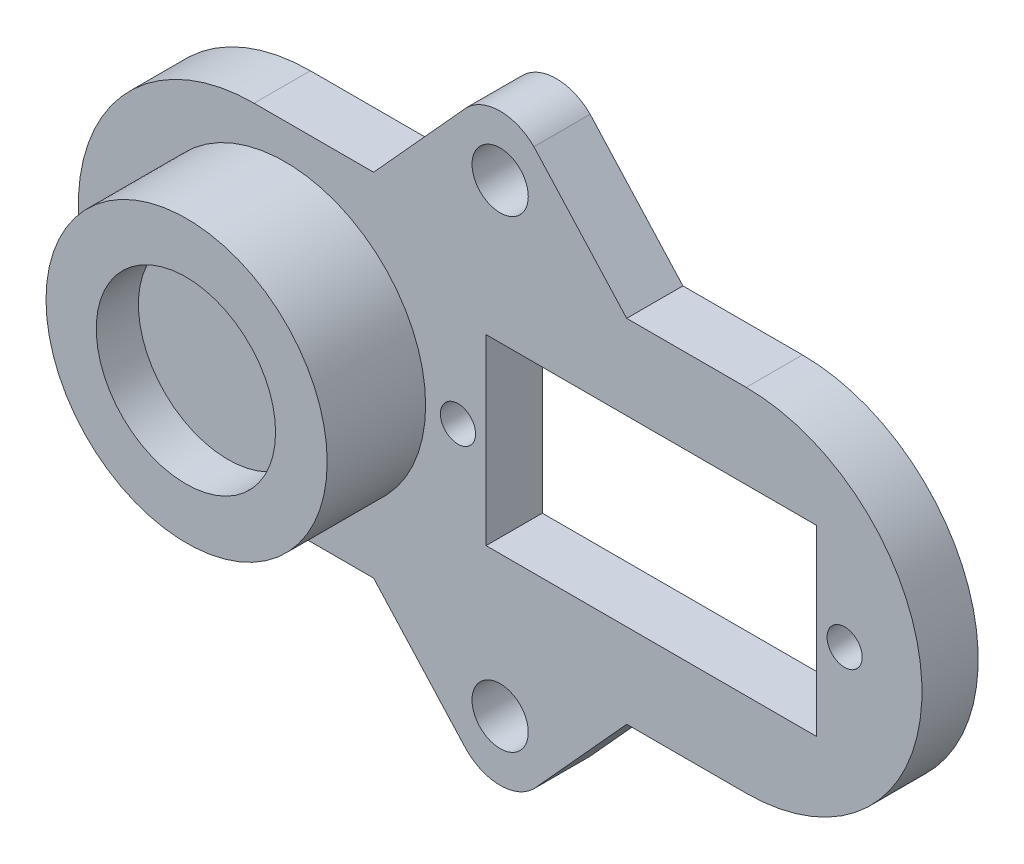
ISO-10303-21;
HEADER;
FILE_DESCRIPTION(('STEP AP214'),'2;1');
FILE_NAME('part.step','',(''),(''),'','','');
FILE_SCHEMA(('AUTOMOTIVE_DESIGN { 1 0 10303 214 1 1 1 1 }'));
ENDSEC;
DATA;
#1=APPLICATION_CONTEXT('core data for automotive mechanical design processes');
#2=APPLICATION_PROTOCOL_DEFINITION('international standard','automotive_design',2000,#1);
#3=PRODUCT_CONTEXT('',#1,'mechanical');
#4=PRODUCT('Part','Part','',(#3));
#5=PRODUCT_RELATED_PRODUCT_CATEGORY('part','',(#4));
#6=PRODUCT_DEFINITION_FORMATION('','',#4);
#7=PRODUCT_DEFINITION_CONTEXT('part definition',#1,'design');
#8=PRODUCT_DEFINITION('design','',#6,#7);
#9=PRODUCT_DEFINITION_SHAPE('','',#8);
#10=(LENGTH_UNIT() NAMED_UNIT(*) SI_UNIT(.MILLI.,.METRE.));
#11=(NAMED_UNIT(*) PLANE_ANGLE_UNIT() SI_UNIT($,.RADIAN.));
#12=(NAMED_UNIT(*) SI_UNIT($,.STERADIAN.) SOLID_ANGLE_UNIT());
#13=UNCERTAINTY_MEASURE_WITH_UNIT(LENGTH_MEASURE(1.E-05),#10,'distance_accuracy_value','');
#14=(GEOMETRIC_REPRESENTATION_CONTEXT(3) GLOBAL_UNCERTAINTY_ASSIGNED_CONTEXT((#13)) GLOBAL_UNIT_ASSIGNED_CONTEXT((#10,
#11,#12)) REPRESENTATION_CONTEXT('',''));
#15=CARTESIAN_POINT('',(0.,0.,0.));
#16=DIRECTION('',(0.,0.,1.));
#17=DIRECTION('',(1.,0.,0.));
#18=AXIS2_PLACEMENT_3D('',#15,#16,#17);
#19=CARTESIAN_POINT('',(17.5,0.,4.));
#20=DIRECTION('',(0.,0.,1.));
#21=DIRECTION('',(1.,0.,0.));
#22=AXIS2_PLACEMENT_3D('',#19,#20,#21);
#23=PLANE('',#22);
#24=CARTESIAN_POINT('',(-15.3,0.,4.));
#25=DIRECTION('',(0.,0.,1.));
#26=DIRECTION('',(1.,0.,0.));
#27=AXIS2_PLACEMENT_3D('',#24,#25,#26);
#28=CIRCLE('',#27,10.);
#29=CARTESIAN_POINT('',(-5.3,0.,4.));
#30=VERTEX_POINT('',#29);
#31=EDGE_CURVE('E644',#30,#30,#28,.T.);
#32=ORIENTED_EDGE('',*,*,#31,.F.);
#33=EDGE_LOOP('',(#32));
#34=FACE_BOUND('',#33,.T.);
#35=CARTESIAN_POINT('',(0.,-16.5,4.));
#36=DIRECTION('',(0.,0.,1.));
#37=DIRECTION('',(-1.,0.,0.));
#38=AXIS2_PLACEMENT_3D('',#35,#36,#37);
#39=CIRCLE('',#38,2.);
#40=CARTESIAN_POINT('',(-2.,-16.5,4.));
#41=VERTEX_POINT('',#40);
#42=EDGE_CURVE('E211',#41,#41,#39,.T.);
#43=ORIENTED_EDGE('',*,*,#42,.F.);
#44=EDGE_LOOP('',(#43));
#45=FACE_BOUND('',#44,.T.);
#46=CARTESIAN_POINT('',(-2.99999999999999,0.,4.));
#47=DIRECTION('',(0.,0.,1.));
#48=DIRECTION('',(1.,0.,0.));
#49=AXIS2_PLACEMENT_3D('',#46,#47,#48);
#50=CIRCLE('',#49,1.25);
#51=CARTESIAN_POINT('',(-1.74999999999999,0.,4.));
#52=VERTEX_POINT('',#51);
#53=EDGE_CURVE('E227',#52,#52,#50,.T.);
#54=ORIENTED_EDGE('',*,*,#53,.F.);
#55=EDGE_LOOP('',(#54));
#56=FACE_BOUND('',#55,.T.);
#57=CARTESIAN_POINT('',(17.5,0.,4.));
#58=DIRECTION('',(0.,0.,1.));
#59=DIRECTION('',(1.,0.,0.));
#60=AXIS2_PLACEMENT_3D('',#57,#58,#59);
#61=CIRCLE('',#60,12.5);
#62=CARTESIAN_POINT('',(17.5,-12.5,4.));
#63=VERTEX_POINT('',#62);
#64=CARTESIAN_POINT('',(17.5,12.5,4.));
#65=VERTEX_POINT('',#64);
#66=EDGE_CURVE('E235',#63,#65,#61,.T.);
#67=ORIENTED_EDGE('',*,*,#66,.T.);
#68=DIRECTION('',(-1.,0.,0.));
#69=VECTOR('',#68,1.);
#70=CARTESIAN_POINT('',(9.,12.5,4.));
#71=LINE('',#70,#69);
#72=CARTESIAN_POINT('',(9.,12.5,4.));
#73=VERTEX_POINT('',#72);
#74=EDGE_CURVE('E239',#65,#73,#71,.T.);
#75=ORIENTED_EDGE('',*,*,#74,.T.);
#76=DIRECTION('',(-0.671988671110962,0.740561426148111,0.));
#77=VECTOR('',#76,1.);
#78=CARTESIAN_POINT('',(2.4010102843855,19.772380391254,4.));
#79=LINE('',#78,#77);
#80=CARTESIAN_POINT('',(2.4010102843855,19.772380391254,4.));
#81=VERTEX_POINT('',#80);
#82=EDGE_CURVE('E243',#73,#81,#79,.T.);
#83=ORIENTED_EDGE('',*,*,#82,.T.);
#84=CARTESIAN_POINT('',(0.,17.3713701068685,4.));
#85=DIRECTION('',(0.,0.,1.));
#86=DIRECTION('',(-1.,0.,0.));
#87=AXIS2_PLACEMENT_3D('',#84,#85,#86);
#88=CIRCLE('',#87,3.39554130757526);
#89=CARTESIAN_POINT('',(-2.4010102843855,19.772380391254,4.));
#90=VERTEX_POINT('',#89);
#91=EDGE_CURVE('E246',#81,#90,#88,.T.);
#92=ORIENTED_EDGE('',*,*,#91,.T.);
#93=DIRECTION('',(-0.671988671110962,-0.740561426148111,0.));
#94=VECTOR('',#93,1.);
#95=CARTESIAN_POINT('',(-9.,12.5,4.));
#96=LINE('',#95,#94);
#97=CARTESIAN_POINT('',(-9.,12.5,4.));
#98=VERTEX_POINT('',#97);
#99=EDGE_CURVE('E249',#90,#98,#96,.T.);
#100=ORIENTED_EDGE('',*,*,#99,.T.);
#101=DIRECTION('',(-1.,0.,0.));
#102=VECTOR('',#101,1.);
#103=CARTESIAN_POINT('',(-17.5,12.5,4.));
#104=LINE('',#103,#102);
#105=CARTESIAN_POINT('',(-17.5,12.5,4.));
#106=VERTEX_POINT('',#105);
#107=EDGE_CURVE('E252',#98,#106,#104,.T.);
#108=ORIENTED_EDGE('',*,*,#107,.T.);
#109=CARTESIAN_POINT('',(-17.5,0.,4.));
#110=DIRECTION('',(0.,0.,1.));
#111=DIRECTION('',(1.,0.,0.));
#112=AXIS2_PLACEMENT_3D('',#109,#110,#111);
#113=CIRCLE('',#112,12.5);
#114=CARTESIAN_POINT('',(-17.5,-12.5,4.));
#115=VERTEX_POINT('',#114);
#116=EDGE_CURVE('E255',#106,#115,#113,.T.);
#117=ORIENTED_EDGE('',*,*,#116,.T.);
#118=DIRECTION('',(1.,0.,0.));
#119=VECTOR('',#118,1.);
#120=CARTESIAN_POINT('',(-17.5,-12.5,4.));
#121=LINE('',#120,#119);
#122=CARTESIAN_POINT('',(-9.,-12.5,4.));
#123=VERTEX_POINT('',#122);
#124=EDGE_CURVE('E258',#115,#123,#121,.T.);
#125=ORIENTED_EDGE('',*,*,#124,.T.);
#126=DIRECTION('',(0.671988671110962,-0.740561426148111,0.));
#127=VECTOR('',#126,1.);
#128=CARTESIAN_POINT('',(-9.,-12.5,4.));
#129=LINE('',#128,#127);
#130=CARTESIAN_POINT('',(-2.4010102843855,-19.772380391254,4.));
#131=VERTEX_POINT('',#130);
#132=EDGE_CURVE('E261',#123,#131,#129,.T.);
#133=ORIENTED_EDGE('',*,*,#132,.T.);
#134=CARTESIAN_POINT('',(0.,-17.3713701068685,4.));
#135=DIRECTION('',(0.,0.,1.));
#136=DIRECTION('',(1.,0.,0.));
#137=AXIS2_PLACEMENT_3D('',#134,#135,#136);
#138=CIRCLE('',#137,3.39554130757526);
#139=CARTESIAN_POINT('',(2.4010102843855,-19.772380391254,4.));
#140=VERTEX_POINT('',#139);
#141=EDGE_CURVE('E264',#131,#140,#138,.T.);
#142=ORIENTED_EDGE('',*,*,#141,.T.);
#143=DIRECTION('',(0.671988671110962,0.740561426148111,0.));
#144=VECTOR('',#143,1.);
#145=CARTESIAN_POINT('',(2.4010102843855,-19.772380391254,4.));
#146=LINE('',#145,#144);
#147=CARTESIAN_POINT('',(9.,-12.5,4.));
#148=VERTEX_POINT('',#147);
#149=EDGE_CURVE('E267',#140,#148,#146,.T.);
#150=ORIENTED_EDGE('',*,*,#149,.T.);
#151=DIRECTION('',(1.,0.,0.));
#152=VECTOR('',#151,1.);
#153=CARTESIAN_POINT('',(9.,-12.5,4.));
#154=LINE('',#153,#152);
#155=EDGE_CURVE('E270',#148,#63,#154,.T.);
#156=ORIENTED_EDGE('',*,*,#155,.T.);
#157=EDGE_LOOP('',(#67,#75,#83,#92,#100,#108,#117,#125,#133,#142,#150,#156));
#158=FACE_BOUND('',#157,.T.);
#159=CARTESIAN_POINT('',(0.,16.5,4.));
#160=DIRECTION('',(0.,0.,1.));
#161=DIRECTION('',(1.,0.,0.));
#162=AXIS2_PLACEMENT_3D('',#159,#160,#161);
#163=CIRCLE('',#162,2.);
#164=CARTESIAN_POINT('',(2.,16.5,4.));
#165=VERTEX_POINT('',#164);
#166=EDGE_CURVE('E219',#165,#165,#163,.T.);
#167=ORIENTED_EDGE('',*,*,#166,.F.);
#168=EDGE_LOOP('',(#167));
#169=FACE_BOUND('',#168,.T.);
#170=CARTESIAN_POINT('',(24.5,0.,4.));
#171=DIRECTION('',(0.,0.,1.));
#172=DIRECTION('',(1.,0.,0.));
#173=AXIS2_PLACEMENT_3D('',#170,#171,#172);
#174=CIRCLE('',#173,1.25);
#175=CARTESIAN_POINT('',(25.75,0.,4.));
#176=VERTEX_POINT('',#175);
#177=EDGE_CURVE('E203',#176,#176,#174,.T.);
#178=ORIENTED_EDGE('',*,*,#177,.F.);
#179=EDGE_LOOP('',(#178));
#180=FACE_BOUND('',#179,.T.);
#181=DIRECTION('',(1.,0.,0.));
#182=VECTOR('',#181,1.);
#183=CARTESIAN_POINT('',(-0.999999999999994,-6.5,4.));
#184=LINE('',#183,#182);
#185=CARTESIAN_POINT('',(-0.999999999999994,-6.5,4.));
#186=VERTEX_POINT('',#185);
#187=CARTESIAN_POINT('',(22.5,-6.5,4.));
#188=VERTEX_POINT('',#187);
#189=EDGE_CURVE('E162',#186,#188,#184,.T.);
#190=ORIENTED_EDGE('',*,*,#189,.F.);
#191=DIRECTION('',(0.,-1.,0.));
#192=VECTOR('',#191,1.);
#193=CARTESIAN_POINT('',(-0.999999999999994,6.5,4.));
#194=LINE('',#193,#192);
#195=CARTESIAN_POINT('',(-0.999999999999994,6.5,4.));
#196=VERTEX_POINT('',#195);
#197=EDGE_CURVE('E153',#196,#186,#194,.T.);
#198=ORIENTED_EDGE('',*,*,#197,.F.);
#199=DIRECTION('',(-1.,0.,0.));
#200=VECTOR('',#199,1.);
#201=CARTESIAN_POINT('',(-0.999999999999994,6.5,4.));
#202=LINE('',#201,#200);
#203=CARTESIAN_POINT('',(22.5,6.5,4.));
#204=VERTEX_POINT('',#203);
#205=EDGE_CURVE('E179',#204,#196,#202,.T.);
#206=ORIENTED_EDGE('',*,*,#205,.F.);
#207=DIRECTION('',(0.,1.,0.));
#208=VECTOR('',#207,1.);
#209=CARTESIAN_POINT('',(22.5,6.5,4.));
#210=LINE('',#209,#208);
#211=EDGE_CURVE('E175',#188,#204,#210,.T.);
#212=ORIENTED_EDGE('',*,*,#211,.F.);
#213=EDGE_LOOP('',(#190,#198,#206,#212));
#214=FACE_BOUND('',#213,.T.);
#215=ADVANCED_FACE('F39',(#34,#45,#56,#158,#169,#180,#214),#23,.T.);
#216=CARTESIAN_POINT('',(17.5,0.,0.));
#217=DIRECTION('',(0.,0.,1.));
#218=DIRECTION('',(1.,0.,0.));
#219=AXIS2_PLACEMENT_3D('',#216,#217,#218);
#220=PLANE('',#219);
#221=CARTESIAN_POINT('',(24.5,0.,0.));
#222=DIRECTION('',(0.,0.,1.));
#223=DIRECTION('',(1.,0.,0.));
#224=AXIS2_PLACEMENT_3D('',#221,#222,#223);
#225=CIRCLE('',#224,1.25);
#226=CARTESIAN_POINT('',(25.75,0.,0.));
#227=VERTEX_POINT('',#226);
#228=EDGE_CURVE('E171',#227,#227,#225,.T.);
#229=ORIENTED_EDGE('',*,*,#228,.T.);
#230=EDGE_LOOP('',(#229));
#231=FACE_BOUND('',#230,.T.);
#232=CARTESIAN_POINT('',(0.,-16.5,0.));
#233=DIRECTION('',(0.,0.,1.));
#234=DIRECTION('',(-1.,0.,0.));
#235=AXIS2_PLACEMENT_3D('',#232,#233,#234);
#236=CIRCLE('',#235,2.);
#237=CARTESIAN_POINT('',(-2.,-16.5,0.));
#238=VERTEX_POINT('',#237);
#239=EDGE_CURVE('E207',#238,#238,#236,.T.);
#240=ORIENTED_EDGE('',*,*,#239,.T.);
#241=EDGE_LOOP('',(#240));
#242=FACE_BOUND('',#241,.T.);
#243=CARTESIAN_POINT('',(0.,16.5,0.));
#244=DIRECTION('',(0.,0.,1.));
#245=DIRECTION('',(1.,0.,0.));
#246=AXIS2_PLACEMENT_3D('',#243,#244,#245);
#247=CIRCLE('',#246,2.);
#248=CARTESIAN_POINT('',(2.,16.5,0.));
#249=VERTEX_POINT('',#248);
#250=EDGE_CURVE('E215',#249,#249,#247,.T.);
#251=ORIENTED_EDGE('',*,*,#250,.T.);
#252=EDGE_LOOP('',(#251));
#253=FACE_BOUND('',#252,.T.);
#254=CARTESIAN_POINT('',(-2.99999999999999,0.,0.));
#255=DIRECTION('',(0.,0.,1.));
#256=DIRECTION('',(1.,0.,0.));
#257=AXIS2_PLACEMENT_3D('',#254,#255,#256);
#258=CIRCLE('',#257,1.25);
#259=CARTESIAN_POINT('',(-1.74999999999999,0.,0.));
#260=VERTEX_POINT('',#259);
#261=EDGE_CURVE('E223',#260,#260,#258,.T.);
#262=ORIENTED_EDGE('',*,*,#261,.T.);
#263=EDGE_LOOP('',(#262));
#264=FACE_BOUND('',#263,.T.);
#265=CARTESIAN_POINT('',(17.5,0.,0.));
#266=DIRECTION('',(0.,0.,1.));
#267=DIRECTION('',(1.,0.,0.));
#268=AXIS2_PLACEMENT_3D('',#265,#266,#267);
#269=CIRCLE('',#268,12.5);
#270=CARTESIAN_POINT('',(17.5,-12.5,0.));
#271=VERTEX_POINT('',#270);
#272=CARTESIAN_POINT('',(17.5,12.5,0.));
#273=VERTEX_POINT('',#272);
#274=EDGE_CURVE('E231',#271,#273,#269,.T.);
#275=ORIENTED_EDGE('',*,*,#274,.F.);
#276=DIRECTION('',(1.,0.,0.));
#277=VECTOR('',#276,1.);
#278=CARTESIAN_POINT('',(9.,-12.5,0.));
#279=LINE('',#278,#277);
#280=CARTESIAN_POINT('',(9.,-12.5,0.));
#281=VERTEX_POINT('',#280);
#282=EDGE_CURVE('E240',#281,#271,#279,.T.);
#283=ORIENTED_EDGE('',*,*,#282,.F.);
#284=DIRECTION('',(0.671988671110962,0.740561426148111,0.));
#285=VECTOR('',#284,1.);
#286=CARTESIAN_POINT('',(2.4010102843855,-19.772380391254,0.));
#287=LINE('',#286,#285);
#288=CARTESIAN_POINT('',(2.4010102843855,-19.772380391254,0.));
#289=VERTEX_POINT('',#288);
#290=EDGE_CURVE('E304',#289,#281,#287,.T.);
#291=ORIENTED_EDGE('',*,*,#290,.F.);
#292=CARTESIAN_POINT('',(0.,-17.3713701068685,0.));
#293=DIRECTION('',(0.,0.,1.));
#294=DIRECTION('',(1.,0.,0.));
#295=AXIS2_PLACEMENT_3D('',#292,#293,#294);
#296=CIRCLE('',#295,3.39554130757526);
#297=CARTESIAN_POINT('',(-2.4010102843855,-19.772380391254,0.));
#298=VERTEX_POINT('',#297);
#299=EDGE_CURVE('E301',#298,#289,#296,.T.);
#300=ORIENTED_EDGE('',*,*,#299,.F.);
#301=DIRECTION('',(0.671988671110962,-0.740561426148111,0.));
#302=VECTOR('',#301,1.);
#303=CARTESIAN_POINT('',(-9.,-12.5,0.));
#304=LINE('',#303,#302);
#305=CARTESIAN_POINT('',(-9.,-12.5,0.));
#306=VERTEX_POINT('',#305);
#307=EDGE_CURVE('E298',#306,#298,#304,.T.);
#308=ORIENTED_EDGE('',*,*,#307,.F.);
#309=DIRECTION('',(1.,0.,0.));
#310=VECTOR('',#309,1.);
#311=CARTESIAN_POINT('',(-17.5,-12.5,0.));
#312=LINE('',#311,#310);
#313=CARTESIAN_POINT('',(-17.5,-12.5,0.));
#314=VERTEX_POINT('',#313);
#315=EDGE_CURVE('E295',#314,#306,#312,.T.);
#316=ORIENTED_EDGE('',*,*,#315,.F.);
#317=CARTESIAN_POINT('',(-17.5,0.,0.));
#318=DIRECTION('',(0.,0.,1.));
#319=DIRECTION('',(1.,0.,0.));
#320=AXIS2_PLACEMENT_3D('',#317,#318,#319);
#321=CIRCLE('',#320,12.5);
#322=CARTESIAN_POINT('',(-17.5,12.5,0.));
#323=VERTEX_POINT('',#322);
#324=EDGE_CURVE('E292',#323,#314,#321,.T.);
#325=ORIENTED_EDGE('',*,*,#324,.F.);
#326=DIRECTION('',(-1.,0.,0.));
#327=VECTOR('',#326,1.);
#328=CARTESIAN_POINT('',(-17.5,12.5,0.));
#329=LINE('',#328,#327);
#330=CARTESIAN_POINT('',(-9.,12.5,0.));
#331=VERTEX_POINT('',#330);
#332=EDGE_CURVE('E289',#331,#323,#329,.T.);
#333=ORIENTED_EDGE('',*,*,#332,.F.);
#334=DIRECTION('',(-0.671988671110962,-0.740561426148111,0.));
#335=VECTOR('',#334,1.);
#336=CARTESIAN_POINT('',(-9.,12.5,0.));
#337=LINE('',#336,#335);
#338=CARTESIAN_POINT('',(-2.4010102843855,19.772380391254,0.));
#339=VERTEX_POINT('',#338);
#340=EDGE_CURVE('E286',#339,#331,#337,.T.);
#341=ORIENTED_EDGE('',*,*,#340,.F.);
#342=CARTESIAN_POINT('',(0.,17.3713701068685,0.));
#343=DIRECTION('',(0.,0.,1.));
#344=DIRECTION('',(-1.,0.,0.));
#345=AXIS2_PLACEMENT_3D('',#342,#343,#344);
#346=CIRCLE('',#345,3.39554130757526);
#347=CARTESIAN_POINT('',(2.4010102843855,19.772380391254,0.));
#348=VERTEX_POINT('',#347);
#349=EDGE_CURVE('E283',#348,#339,#346,.T.);
#350=ORIENTED_EDGE('',*,*,#349,.F.);
#351=DIRECTION('',(-0.671988671110962,0.740561426148111,0.));
#352=VECTOR('',#351,1.);
#353=CARTESIAN_POINT('',(2.4010102843855,19.772380391254,0.));
#354=LINE('',#353,#352);
#355=CARTESIAN_POINT('',(9.,12.5,0.));
#356=VERTEX_POINT('',#355);
#357=EDGE_CURVE('E280',#356,#348,#354,.T.);
#358=ORIENTED_EDGE('',*,*,#357,.F.);
#359=DIRECTION('',(-1.,0.,0.));
#360=VECTOR('',#359,1.);
#361=CARTESIAN_POINT('',(9.,12.5,0.));
#362=LINE('',#361,#360);
#363=EDGE_CURVE('E277',#273,#356,#362,.T.);
#364=ORIENTED_EDGE('',*,*,#363,.F.);
#365=EDGE_LOOP('',(#275,#283,#291,#300,#308,#316,#325,#333,#341,#350,#358,#364));
#366=FACE_BOUND('',#365,.T.);
#367=DIRECTION('',(0.,-1.,0.));
#368=VECTOR('',#367,1.);
#369=CARTESIAN_POINT('',(-0.999999999999994,6.5,0.));
#370=LINE('',#369,#368);
#371=CARTESIAN_POINT('',(-0.999999999999994,6.5,0.));
#372=VERTEX_POINT('',#371);
#373=CARTESIAN_POINT('',(-0.999999999999994,-6.5,0.));
#374=VERTEX_POINT('',#373);
#375=EDGE_CURVE('E63',#372,#374,#370,.T.);
#376=ORIENTED_EDGE('',*,*,#375,.T.);
#377=DIRECTION('',(1.,0.,0.));
#378=VECTOR('',#377,1.);
#379=CARTESIAN_POINT('',(-0.999999999999994,-6.5,0.));
#380=LINE('',#379,#378);
#381=CARTESIAN_POINT('',(22.5,-6.5,0.));
#382=VERTEX_POINT('',#381);
#383=EDGE_CURVE('E169',#374,#382,#380,.T.);
#384=ORIENTED_EDGE('',*,*,#383,.T.);
#385=DIRECTION('',(0.,1.,0.));
#386=VECTOR('',#385,1.);
#387=CARTESIAN_POINT('',(22.5,6.5,0.));
#388=LINE('',#387,#386);
#389=CARTESIAN_POINT('',(22.5,6.5,0.));
#390=VERTEX_POINT('',#389);
#391=EDGE_CURVE('E190',#382,#390,#388,.T.);
#392=ORIENTED_EDGE('',*,*,#391,.T.);
#393=DIRECTION('',(-1.,0.,0.));
#394=VECTOR('',#393,1.);
#395=CARTESIAN_POINT('',(-0.999999999999994,6.5,0.));
#396=LINE('',#395,#394);
#397=EDGE_CURVE('E163',#390,#372,#396,.T.);
#398=ORIENTED_EDGE('',*,*,#397,.T.);
#399=EDGE_LOOP('',(#376,#384,#392,#398));
#400=FACE_BOUND('',#399,.T.);
#401=ADVANCED_FACE('F359',(#231,#242,#253,#264,#366,#400),#220,.F.);
#402=CARTESIAN_POINT('',(17.5,0.,4.));
#403=DIRECTION('',(0.,0.,-1.));
#404=DIRECTION('',(-1.,0.,0.));
#405=AXIS2_PLACEMENT_3D('',#402,#403,#404);
#406=CYLINDRICAL_SURFACE('',#405,12.5);
#407=ORIENTED_EDGE('',*,*,#274,.T.);
#408=DIRECTION('',(0.,0.,-1.));
#409=VECTOR('',#408,1.);
#410=CARTESIAN_POINT('',(17.5,12.5,4.));
#411=LINE('',#410,#409);
#412=EDGE_CURVE('E11',#65,#273,#411,.T.);
#413=ORIENTED_EDGE('',*,*,#412,.F.);
#414=ORIENTED_EDGE('',*,*,#66,.F.);
#415=DIRECTION('',(0.,0.,-1.));
#416=VECTOR('',#415,1.);
#417=CARTESIAN_POINT('',(17.5,-12.5,4.));
#418=LINE('',#417,#416);
#419=EDGE_CURVE('E273',#63,#271,#418,.T.);
#420=ORIENTED_EDGE('',*,*,#419,.T.);
#421=EDGE_LOOP('',(#407,#413,#414,#420));
#422=FACE_BOUND('',#421,.T.);
#423=ADVANCED_FACE('F41',(#422),#406,.T.);
#424=CARTESIAN_POINT('',(9.,12.5,4.));
#425=DIRECTION('',(0.,-1.,0.));
#426=DIRECTION('',(1.,0.,0.));
#427=AXIS2_PLACEMENT_3D('',#424,#425,#426);
#428=PLANE('',#427);
#429=ORIENTED_EDGE('',*,*,#363,.T.);
#430=DIRECTION('',(0.,0.,-1.));
#431=VECTOR('',#430,1.);
#432=CARTESIAN_POINT('',(9.,12.5,4.));
#433=LINE('',#432,#431);
#434=EDGE_CURVE('E48',#73,#356,#433,.T.);
#435=ORIENTED_EDGE('',*,*,#434,.F.);
#436=ORIENTED_EDGE('',*,*,#74,.F.);
#437=ORIENTED_EDGE('',*,*,#412,.T.);
#438=EDGE_LOOP('',(#429,#435,#436,#437));
#439=FACE_BOUND('',#438,.T.);
#440=ADVANCED_FACE('F377',(#439),#428,.F.);
#441=CARTESIAN_POINT('',(2.4010102843855,19.772380391254,4.));
#442=DIRECTION('',(-0.740561426148111,-0.671988671110962,0.));
#443=DIRECTION('',(0.671988671110962,-0.740561426148111,0.));
#444=AXIS2_PLACEMENT_3D('',#441,#442,#443);
#445=PLANE('',#444);
#446=ORIENTED_EDGE('',*,*,#357,.T.);
#447=DIRECTION('',(0.,0.,-1.));
#448=VECTOR('',#447,1.);
#449=CARTESIAN_POINT('',(2.4010102843855,19.772380391254,4.));
#450=LINE('',#449,#448);
#451=EDGE_CURVE('E344',#81,#348,#450,.T.);
#452=ORIENTED_EDGE('',*,*,#451,.F.);
#453=ORIENTED_EDGE('',*,*,#82,.F.);
#454=ORIENTED_EDGE('',*,*,#434,.T.);
#455=EDGE_LOOP('',(#446,#452,#453,#454));
#456=FACE_BOUND('',#455,.T.);
#457=ADVANCED_FACE('F353',(#456),#445,.F.);
#458=CARTESIAN_POINT('',(0.,17.3713701068685,4.));
#459=DIRECTION('',(0.,0.,-1.));
#460=DIRECTION('',(-1.,0.,0.));
#461=AXIS2_PLACEMENT_3D('',#458,#459,#460);
#462=CYLINDRICAL_SURFACE('',#461,3.39554130757526);
#463=ORIENTED_EDGE('',*,*,#349,.T.);
#464=DIRECTION('',(0.,0.,-1.));
#465=VECTOR('',#464,1.);
#466=CARTESIAN_POINT('',(-2.4010102843855,19.772380391254,4.));
#467=LINE('',#466,#465);
#468=EDGE_CURVE('E340',#90,#339,#467,.T.);
#469=ORIENTED_EDGE('',*,*,#468,.F.);
#470=ORIENTED_EDGE('',*,*,#91,.F.);
#471=ORIENTED_EDGE('',*,*,#451,.T.);
#472=EDGE_LOOP('',(#463,#469,#470,#471));
#473=FACE_BOUND('',#472,.T.);
#474=ADVANCED_FACE('F365',(#473),#462,.T.);
#475=CARTESIAN_POINT('',(-9.,12.5,4.));
#476=DIRECTION('',(0.740561426148111,-0.671988671110962,0.));
#477=DIRECTION('',(0.671988671110962,0.740561426148111,0.));
#478=AXIS2_PLACEMENT_3D('',#475,#476,#477);
#479=PLANE('',#478);
#480=ORIENTED_EDGE('',*,*,#340,.T.);
#481=DIRECTION('',(0.,0.,-1.));
#482=VECTOR('',#481,1.);
#483=CARTESIAN_POINT('',(-9.,12.5,4.));
#484=LINE('',#483,#482);
#485=EDGE_CURVE('E336',#98,#331,#484,.T.);
#486=ORIENTED_EDGE('',*,*,#485,.F.);
#487=ORIENTED_EDGE('',*,*,#99,.F.);
#488=ORIENTED_EDGE('',*,*,#468,.T.);
#489=EDGE_LOOP('',(#480,#486,#487,#488));
#490=FACE_BOUND('',#489,.T.);
#491=ADVANCED_FACE('F369',(#490),#479,.F.);
#492=CARTESIAN_POINT('',(-17.5,12.5,4.));
#493=DIRECTION('',(0.,-1.,0.));
#494=DIRECTION('',(1.,0.,0.));
#495=AXIS2_PLACEMENT_3D('',#492,#493,#494);
#496=PLANE('',#495);
#497=ORIENTED_EDGE('',*,*,#332,.T.);
#498=DIRECTION('',(0.,0.,-1.));
#499=VECTOR('',#498,1.);
#500=CARTESIAN_POINT('',(-17.5,12.5,4.));
#501=LINE('',#500,#499);
#502=EDGE_CURVE('E332',#106,#323,#501,.T.);
#503=ORIENTED_EDGE('',*,*,#502,.F.);
#504=ORIENTED_EDGE('',*,*,#107,.F.);
#505=ORIENTED_EDGE('',*,*,#485,.T.);
#506=EDGE_LOOP('',(#497,#503,#504,#505));
#507=FACE_BOUND('',#506,.T.);
#508=ADVANCED_FACE('F410',(#507),#496,.F.);
#509=CARTESIAN_POINT('',(-17.5,0.,4.));
#510=DIRECTION('',(0.,0.,-1.));
#511=DIRECTION('',(-1.,0.,0.));
#512=AXIS2_PLACEMENT_3D('',#509,#510,#511);
#513=CYLINDRICAL_SURFACE('',#512,12.5);
#514=ORIENTED_EDGE('',*,*,#324,.T.);
#515=DIRECTION('',(0.,0.,-1.));
#516=VECTOR('',#515,1.);
#517=CARTESIAN_POINT('',(-17.5,-12.5,4.));
#518=LINE('',#517,#516);
#519=EDGE_CURVE('E328',#115,#314,#518,.T.);
#520=ORIENTED_EDGE('',*,*,#519,.F.);
#521=ORIENTED_EDGE('',*,*,#116,.F.);
#522=ORIENTED_EDGE('',*,*,#502,.T.);
#523=EDGE_LOOP('',(#514,#520,#521,#522));
#524=FACE_BOUND('',#523,.T.);
#525=ADVANCED_FACE('F408',(#524),#513,.T.);
#526=CARTESIAN_POINT('',(-17.5,-12.5,4.));
#527=DIRECTION('',(0.,1.,0.));
#528=DIRECTION('',(-1.,0.,0.));
#529=AXIS2_PLACEMENT_3D('',#526,#527,#528);
#530=PLANE('',#529);
#531=ORIENTED_EDGE('',*,*,#315,.T.);
#532=DIRECTION('',(0.,0.,-1.));
#533=VECTOR('',#532,1.);
#534=CARTESIAN_POINT('',(-9.,-12.5,4.));
#535=LINE('',#534,#533);
#536=EDGE_CURVE('E324',#123,#306,#535,.T.);
#537=ORIENTED_EDGE('',*,*,#536,.F.);
#538=ORIENTED_EDGE('',*,*,#124,.F.);
#539=ORIENTED_EDGE('',*,*,#519,.T.);
#540=EDGE_LOOP('',(#531,#537,#538,#539));
#541=FACE_BOUND('',#540,.T.);
#542=ADVANCED_FACE('F404',(#541),#530,.F.);
#543=CARTESIAN_POINT('',(-9.,-12.5,4.));
#544=DIRECTION('',(0.740561426148111,0.671988671110962,0.));
#545=DIRECTION('',(-0.671988671110962,0.740561426148111,0.));
#546=AXIS2_PLACEMENT_3D('',#543,#544,#545);
#547=PLANE('',#546);
#548=ORIENTED_EDGE('',*,*,#307,.T.);
#549=DIRECTION('',(0.,0.,-1.));
#550=VECTOR('',#549,1.);
#551=CARTESIAN_POINT('',(-2.4010102843855,-19.772380391254,4.));
#552=LINE('',#551,#550);
#553=EDGE_CURVE('E320',#131,#298,#552,.T.);
#554=ORIENTED_EDGE('',*,*,#553,.F.);
#555=ORIENTED_EDGE('',*,*,#132,.F.);
#556=ORIENTED_EDGE('',*,*,#536,.T.);
#557=EDGE_LOOP('',(#548,#554,#555,#556));
#558=FACE_BOUND('',#557,.T.);
#559=ADVANCED_FACE('F399',(#558),#547,.F.);
#560=CARTESIAN_POINT('',(0.,-17.3713701068685,4.));
#561=DIRECTION('',(0.,0.,-1.));
#562=DIRECTION('',(-1.,0.,0.));
#563=AXIS2_PLACEMENT_3D('',#560,#561,#562);
#564=CYLINDRICAL_SURFACE('',#563,3.39554130757526);
#565=ORIENTED_EDGE('',*,*,#299,.T.);
#566=DIRECTION('',(0.,0.,-1.));
#567=VECTOR('',#566,1.);
#568=CARTESIAN_POINT('',(2.4010102843855,-19.772380391254,4.));
#569=LINE('',#568,#567);
#570=EDGE_CURVE('E316',#140,#289,#569,.T.);
#571=ORIENTED_EDGE('',*,*,#570,.F.);
#572=ORIENTED_EDGE('',*,*,#141,.F.);
#573=ORIENTED_EDGE('',*,*,#553,.T.);
#574=EDGE_LOOP('',(#565,#571,#572,#573));
#575=FACE_BOUND('',#574,.T.);
#576=ADVANCED_FACE('F393',(#575),#564,.T.);
#577=CARTESIAN_POINT('',(2.4010102843855,-19.772380391254,4.));
#578=DIRECTION('',(-0.740561426148111,0.671988671110962,0.));
#579=DIRECTION('',(-0.671988671110962,-0.740561426148111,0.));
#580=AXIS2_PLACEMENT_3D('',#577,#578,#579);
#581=PLANE('',#580);
#582=ORIENTED_EDGE('',*,*,#290,.T.);
#583=DIRECTION('',(0.,0.,-1.));
#584=VECTOR('',#583,1.);
#585=CARTESIAN_POINT('',(9.,-12.5,4.));
#586=LINE('',#585,#584);
#587=EDGE_CURVE('E312',#148,#281,#586,.T.);
#588=ORIENTED_EDGE('',*,*,#587,.F.);
#589=ORIENTED_EDGE('',*,*,#149,.F.);
#590=ORIENTED_EDGE('',*,*,#570,.T.);
#591=EDGE_LOOP('',(#582,#588,#589,#590));
#592=FACE_BOUND('',#591,.T.);
#593=ADVANCED_FACE('F389',(#592),#581,.F.);
#594=CARTESIAN_POINT('',(9.,-12.5,4.));
#595=DIRECTION('',(0.,1.,0.));
#596=DIRECTION('',(-1.,0.,0.));
#597=AXIS2_PLACEMENT_3D('',#594,#595,#596);
#598=PLANE('',#597);
#599=ORIENTED_EDGE('',*,*,#282,.T.);
#600=ORIENTED_EDGE('',*,*,#419,.F.);
#601=ORIENTED_EDGE('',*,*,#155,.F.);
#602=ORIENTED_EDGE('',*,*,#587,.T.);
#603=EDGE_LOOP('',(#599,#600,#601,#602));
#604=FACE_BOUND('',#603,.T.);
#605=ADVANCED_FACE('F384',(#604),#598,.F.);
#606=CARTESIAN_POINT('',(-2.99999999999999,0.,4.));
#607=DIRECTION('',(0.,0.,-1.));
#608=DIRECTION('',(-1.,0.,0.));
#609=AXIS2_PLACEMENT_3D('',#606,#607,#608);
#610=CYLINDRICAL_SURFACE('',#609,1.25);
#611=ORIENTED_EDGE('',*,*,#53,.T.);
#612=EDGE_LOOP('',(#611));
#613=FACE_BOUND('',#612,.T.);
#614=ORIENTED_EDGE('',*,*,#261,.F.);
#615=EDGE_LOOP('',(#614));
#616=FACE_BOUND('',#615,.T.);
#617=ADVANCED_FACE('F430',(#613,#616),#610,.F.);
#618=CARTESIAN_POINT('',(0.,16.5,4.));
#619=DIRECTION('',(0.,0.,-1.));
#620=DIRECTION('',(-1.,0.,0.));
#621=AXIS2_PLACEMENT_3D('',#618,#619,#620);
#622=CYLINDRICAL_SURFACE('',#621,2.);
#623=ORIENTED_EDGE('',*,*,#166,.T.);
#624=EDGE_LOOP('',(#623));
#625=FACE_BOUND('',#624,.T.);
#626=ORIENTED_EDGE('',*,*,#250,.F.);
#627=EDGE_LOOP('',(#626));
#628=FACE_BOUND('',#627,.T.);
#629=ADVANCED_FACE('F468',(#625,#628),#622,.F.);
#630=CARTESIAN_POINT('',(0.,-16.5,4.));
#631=DIRECTION('',(0.,0.,-1.));
#632=DIRECTION('',(-1.,0.,0.));
#633=AXIS2_PLACEMENT_3D('',#630,#631,#632);
#634=CYLINDRICAL_SURFACE('',#633,2.);
#635=ORIENTED_EDGE('',*,*,#42,.T.);
#636=EDGE_LOOP('',(#635));
#637=FACE_BOUND('',#636,.T.);
#638=ORIENTED_EDGE('',*,*,#239,.F.);
#639=EDGE_LOOP('',(#638));
#640=FACE_BOUND('',#639,.T.);
#641=ADVANCED_FACE('F475',(#637,#640),#634,.F.);
#642=CARTESIAN_POINT('',(24.5,0.,4.));
#643=DIRECTION('',(0.,0.,-1.));
#644=DIRECTION('',(-1.,0.,0.));
#645=AXIS2_PLACEMENT_3D('',#642,#643,#644);
#646=CYLINDRICAL_SURFACE('',#645,1.25);
#647=ORIENTED_EDGE('',*,*,#177,.T.);
#648=EDGE_LOOP('',(#647));
#649=FACE_BOUND('',#648,.T.);
#650=ORIENTED_EDGE('',*,*,#228,.F.);
#651=EDGE_LOOP('',(#650));
#652=FACE_BOUND('',#651,.T.);
#653=ADVANCED_FACE('F482',(#649,#652),#646,.F.);
#654=CARTESIAN_POINT('',(-0.999999999999994,6.5,4.));
#655=DIRECTION('',(1.,0.,0.));
#656=DIRECTION('',(0.,0.,-1.));
#657=AXIS2_PLACEMENT_3D('',#654,#655,#656);
#658=PLANE('',#657);
#659=ORIENTED_EDGE('',*,*,#375,.F.);
#660=DIRECTION('',(0.,0.,-1.));
#661=VECTOR('',#660,1.);
#662=CARTESIAN_POINT('',(-0.999999999999994,6.5,4.));
#663=LINE('',#662,#661);
#664=EDGE_CURVE('E157',#196,#372,#663,.T.);
#665=ORIENTED_EDGE('',*,*,#664,.F.);
#666=ORIENTED_EDGE('',*,*,#197,.T.);
#667=DIRECTION('',(0.,0.,-1.));
#668=VECTOR('',#667,1.);
#669=CARTESIAN_POINT('',(-0.999999999999994,-6.5,4.));
#670=LINE('',#669,#668);
#671=EDGE_CURVE('E156',#186,#374,#670,.T.);
#672=ORIENTED_EDGE('',*,*,#671,.T.);
#673=EDGE_LOOP('',(#659,#665,#666,#672));
#674=FACE_BOUND('',#673,.T.);
#675=ADVANCED_FACE('F155',(#674),#658,.T.);
#676=CARTESIAN_POINT('',(-0.999999999999994,-6.5,4.));
#677=DIRECTION('',(0.,1.,0.));
#678=DIRECTION('',(0.,0.,1.));
#679=AXIS2_PLACEMENT_3D('',#676,#677,#678);
#680=PLANE('',#679);
#681=ORIENTED_EDGE('',*,*,#383,.F.);
#682=ORIENTED_EDGE('',*,*,#671,.F.);
#683=ORIENTED_EDGE('',*,*,#189,.T.);
#684=DIRECTION('',(0.,0.,-1.));
#685=VECTOR('',#684,1.);
#686=CARTESIAN_POINT('',(22.5,-6.5,4.));
#687=LINE('',#686,#685);
#688=EDGE_CURVE('E172',#188,#382,#687,.T.);
#689=ORIENTED_EDGE('',*,*,#688,.T.);
#690=EDGE_LOOP('',(#681,#682,#683,#689));
#691=FACE_BOUND('',#690,.T.);
#692=ADVANCED_FACE('F166',(#691),#680,.T.);
#693=CARTESIAN_POINT('',(22.5,6.5,4.));
#694=DIRECTION('',(-1.,0.,0.));
#695=DIRECTION('',(0.,0.,1.));
#696=AXIS2_PLACEMENT_3D('',#693,#694,#695);
#697=PLANE('',#696);
#698=ORIENTED_EDGE('',*,*,#391,.F.);
#699=ORIENTED_EDGE('',*,*,#688,.F.);
#700=ORIENTED_EDGE('',*,*,#211,.T.);
#701=DIRECTION('',(0.,0.,-1.));
#702=VECTOR('',#701,1.);
#703=CARTESIAN_POINT('',(22.5,6.5,4.));
#704=LINE('',#703,#702);
#705=EDGE_CURVE('E55',#204,#390,#704,.T.);
#706=ORIENTED_EDGE('',*,*,#705,.T.);
#707=EDGE_LOOP('',(#698,#699,#700,#706));
#708=FACE_BOUND('',#707,.T.);
#709=ADVANCED_FACE('F503',(#708),#697,.T.);
#710=CARTESIAN_POINT('',(-0.999999999999994,6.5,4.));
#711=DIRECTION('',(0.,-1.,0.));
#712=DIRECTION('',(0.,0.,-1.));
#713=AXIS2_PLACEMENT_3D('',#710,#711,#712);
#714=PLANE('',#713);
#715=ORIENTED_EDGE('',*,*,#397,.F.);
#716=ORIENTED_EDGE('',*,*,#705,.F.);
#717=ORIENTED_EDGE('',*,*,#205,.T.);
#718=ORIENTED_EDGE('',*,*,#664,.T.);
#719=EDGE_LOOP('',(#715,#716,#717,#718));
#720=FACE_BOUND('',#719,.T.);
#721=ADVANCED_FACE('F510',(#720),#714,.T.);
#722=CARTESIAN_POINT('',(-15.3,0.,11.));
#723=DIRECTION('',(0.,0.,-1.));
#724=DIRECTION('',(-1.,0.,0.));
#725=AXIS2_PLACEMENT_3D('',#722,#723,#724);
#726=CYLINDRICAL_SURFACE('',#725,10.);
#727=CARTESIAN_POINT('',(-15.3,0.,11.));
#728=DIRECTION('',(0.,0.,1.));
#729=DIRECTION('',(1.,0.,0.));
#730=AXIS2_PLACEMENT_3D('',#727,#728,#729);
#731=CIRCLE('',#730,10.);
#732=CARTESIAN_POINT('',(-5.3,0.,11.));
#733=VERTEX_POINT('',#732);
#734=EDGE_CURVE('E187',#733,#733,#731,.T.);
#735=ORIENTED_EDGE('',*,*,#734,.F.);
#736=EDGE_LOOP('',(#735));
#737=FACE_BOUND('',#736,.T.);
#738=ORIENTED_EDGE('',*,*,#31,.T.);
#739=EDGE_LOOP('',(#738));
#740=FACE_BOUND('',#739,.T.);
#741=ADVANCED_FACE('F518',(#737,#740),#726,.T.);
#742=CARTESIAN_POINT('',(-15.3,0.,11.));
#743=DIRECTION('',(0.,0.,1.));
#744=DIRECTION('',(1.,0.,0.));
#745=AXIS2_PLACEMENT_3D('',#742,#743,#744);
#746=PLANE('',#745);
#747=CARTESIAN_POINT('',(-15.35,0.,11.));
#748=DIRECTION('',(0.,0.,1.));
#749=DIRECTION('',(1.,0.,0.));
#750=AXIS2_PLACEMENT_3D('',#747,#748,#749);
#751=CIRCLE('',#750,6.37750619537964);
#752=CARTESIAN_POINT('',(-8.97249380462036,0.,11.));
#753=VERTEX_POINT('',#752);
#754=EDGE_CURVE('E645',#753,#753,#751,.T.);
#755=ORIENTED_EDGE('',*,*,#754,.F.);
#756=EDGE_LOOP('',(#755));
#757=FACE_BOUND('',#756,.T.);
#758=ORIENTED_EDGE('',*,*,#734,.T.);
#759=EDGE_LOOP('',(#758));
#760=FACE_BOUND('',#759,.T.);
#761=ADVANCED_FACE('F525',(#757,#760),#746,.T.);
#762=CARTESIAN_POINT('',(-15.35,0.,8.));
#763=DIRECTION('',(0.,0.,1.));
#764=DIRECTION('',(1.,0.,0.));
#765=AXIS2_PLACEMENT_3D('',#762,#763,#764);
#766=CYLINDRICAL_SURFACE('',#765,6.37750619537964);
#767=CARTESIAN_POINT('',(-15.35,0.,8.));
#768=DIRECTION('',(0.,0.,1.));
#769=DIRECTION('',(1.,0.,0.));
#770=AXIS2_PLACEMENT_3D('',#767,#768,#769);
#771=CIRCLE('',#770,6.37750619537964);
#772=CARTESIAN_POINT('',(-8.97249380462036,0.,8.));
#773=VERTEX_POINT('',#772);
#774=EDGE_CURVE('E642',#773,#773,#771,.T.);
#775=ORIENTED_EDGE('',*,*,#774,.F.);
#776=EDGE_LOOP('',(#775));
#777=FACE_BOUND('',#776,.T.);
#778=ORIENTED_EDGE('',*,*,#754,.T.);
#779=EDGE_LOOP('',(#778));
#780=FACE_BOUND('',#779,.T.);
#781=ADVANCED_FACE('F533',(#777,#780),#766,.F.);
#782=CARTESIAN_POINT('',(-15.35,0.,8.));
#783=DIRECTION('',(0.,0.,1.));
#784=DIRECTION('',(1.,0.,0.));
#785=AXIS2_PLACEMENT_3D('',#782,#783,#784);
#786=PLANE('',#785);
#787=ORIENTED_EDGE('',*,*,#774,.T.);
#788=EDGE_LOOP('',(#787));
#789=FACE_BOUND('',#788,.T.);
#790=ADVANCED_FACE('F541',(#789),#786,.T.);
#791=CLOSED_SHELL('',(#215,#401,#423,#440,#457,#474,#491,#508,#525,#542,#559,#576,#593,#605,
#617,#629,#641,#653,#675,#692,#709,#721,#741,#761,#781,#790));
#792=MANIFOLD_SOLID_BREP('B2',#791);
#793=ADVANCED_BREP_SHAPE_REPRESENTATION('',(#18,#792),#14);
#794=SHAPE_DEFINITION_REPRESENTATION(#9,#793);
ENDSEC;
END-ISO-10303-21;
